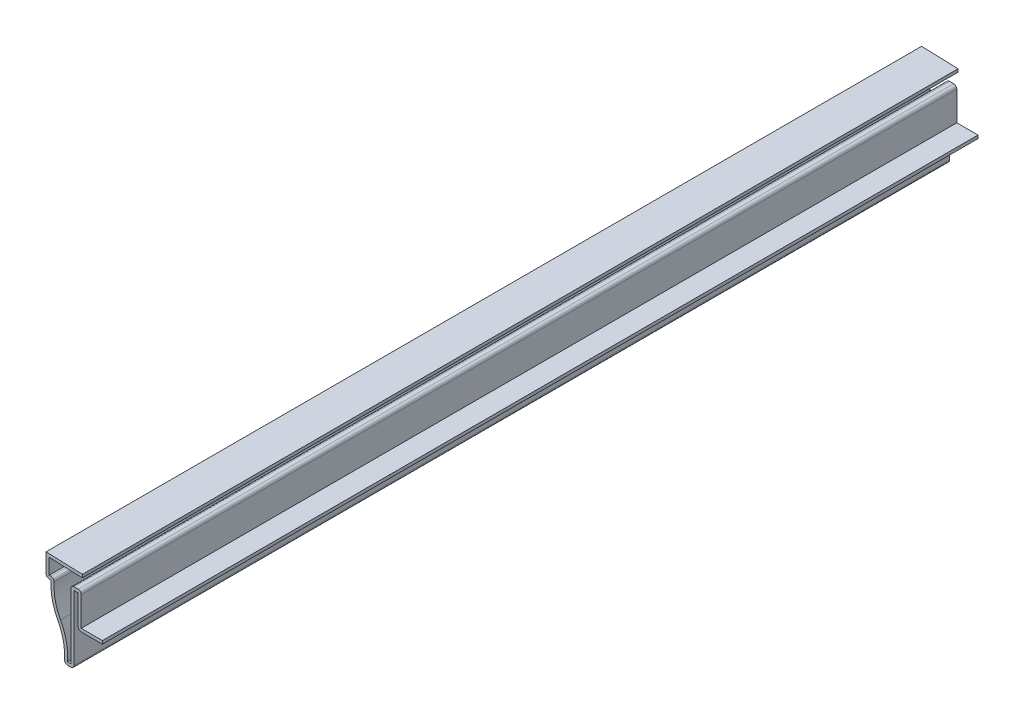
ISO-10303-21;
HEADER;
FILE_DESCRIPTION(('STEP AP214'),'2;1');
FILE_NAME('part.step','',(''),(''),'','','');
FILE_SCHEMA(('AUTOMOTIVE_DESIGN { 1 0 10303 214 1 1 1 1 }'));
ENDSEC;
DATA;
#1=APPLICATION_CONTEXT('core data for automotive mechanical design processes');
#2=APPLICATION_PROTOCOL_DEFINITION('international standard','automotive_design',2000,#1);
#3=PRODUCT_CONTEXT('',#1,'mechanical');
#4=PRODUCT('Part','Part','',(#3));
#5=PRODUCT_RELATED_PRODUCT_CATEGORY('part','',(#4));
#6=PRODUCT_DEFINITION_FORMATION('','',#4);
#7=PRODUCT_DEFINITION_CONTEXT('part definition',#1,'design');
#8=PRODUCT_DEFINITION('design','',#6,#7);
#9=PRODUCT_DEFINITION_SHAPE('','',#8);
#10=(LENGTH_UNIT() NAMED_UNIT(*) SI_UNIT(.MILLI.,.METRE.));
#11=(NAMED_UNIT(*) PLANE_ANGLE_UNIT() SI_UNIT($,.RADIAN.));
#12=(NAMED_UNIT(*) SI_UNIT($,.STERADIAN.) SOLID_ANGLE_UNIT());
#13=UNCERTAINTY_MEASURE_WITH_UNIT(LENGTH_MEASURE(1.E-05),#10,'distance_accuracy_value','');
#14=(GEOMETRIC_REPRESENTATION_CONTEXT(3) GLOBAL_UNCERTAINTY_ASSIGNED_CONTEXT((#13)) GLOBAL_UNIT_ASSIGNED_CONTEXT((#10,
#11,#12)) REPRESENTATION_CONTEXT('',''));
#15=CARTESIAN_POINT('',(0.,0.,0.));
#16=DIRECTION('',(0.,0.,1.));
#17=DIRECTION('',(1.,0.,0.));
#18=AXIS2_PLACEMENT_3D('',#15,#16,#17);
#19=CARTESIAN_POINT('',(0.,0.,-285.75));
#20=DIRECTION('',(0.,-1.,0.));
#21=DIRECTION('',(1.,0.,0.));
#22=AXIS2_PLACEMENT_3D('',#19,#20,#21);
#23=PLANE('',#22);
#24=DIRECTION('',(1.,0.,0.));
#25=VECTOR('',#24,1.);
#26=CARTESIAN_POINT('',(0.,0.,0.));
#27=LINE('',#26,#25);
#28=CARTESIAN_POINT('',(-2.06337759684985,0.,0.));
#29=VERTEX_POINT('',#28);
#30=CARTESIAN_POINT('',(-1.016,0.,0.));
#31=VERTEX_POINT('',#30);
#32=EDGE_CURVE('E300',#29,#31,#27,.T.);
#33=ORIENTED_EDGE('',*,*,#32,.F.);
#34=DIRECTION('',(0.,0.,1.));
#35=VECTOR('',#34,1.);
#36=CARTESIAN_POINT('',(-2.06337759684985,0.,-285.75));
#37=LINE('',#36,#35);
#38=CARTESIAN_POINT('',(-2.06337759684985,0.,-285.75));
#39=VERTEX_POINT('',#38);
#40=EDGE_CURVE('E410',#29,#39,#37,.F.);
#41=ORIENTED_EDGE('',*,*,#40,.T.);
#42=DIRECTION('',(1.,0.,0.));
#43=VECTOR('',#42,1.);
#44=CARTESIAN_POINT('',(0.,0.,-285.75));
#45=LINE('',#44,#43);
#46=CARTESIAN_POINT('',(-1.016,0.,-285.75));
#47=VERTEX_POINT('',#46);
#48=EDGE_CURVE('E234',#39,#47,#45,.T.);
#49=ORIENTED_EDGE('',*,*,#48,.T.);
#50=DIRECTION('',(0.,0.,1.));
#51=VECTOR('',#50,1.);
#52=CARTESIAN_POINT('',(-1.016,0.,-285.75));
#53=LINE('',#52,#51);
#54=EDGE_CURVE('E407',#47,#31,#53,.T.);
#55=ORIENTED_EDGE('',*,*,#54,.T.);
#56=EDGE_LOOP('',(#33,#41,#49,#55));
#57=FACE_BOUND('',#56,.T.);
#58=ADVANCED_FACE('F35',(#57),#23,.T.);
#59=CARTESIAN_POINT('',(-22.0911165975646,2.25455824217122,-285.75));
#60=DIRECTION('',(0.,0.,1.));
#61=DIRECTION('',(1.,0.,0.));
#62=AXIS2_PLACEMENT_3D('',#59,#60,#61);
#63=CYLINDRICAL_SURFACE('',#62,19.05);
#64=CARTESIAN_POINT('',(-22.0911165975646,2.25455824217122,-285.75));
#65=DIRECTION('',(0.,0.,-1.));
#66=DIRECTION('',(1.,0.,0.));
#67=AXIS2_PLACEMENT_3D('',#64,#65,#66);
#68=CIRCLE('',#67,19.05);
#69=CARTESIAN_POINT('',(-5.29087079878227,11.2353288717162,-285.75));
#70=VERTEX_POINT('',#69);
#71=CARTESIAN_POINT('',(-3.07744033106325,1.07871180973019,-285.75));
#72=VERTEX_POINT('',#71);
#73=EDGE_CURVE('E242',#70,#72,#68,.T.);
#74=ORIENTED_EDGE('',*,*,#73,.T.);
#75=DIRECTION('',(0.,0.,1.));
#76=VECTOR('',#75,1.);
#77=CARTESIAN_POINT('',(-3.07744033106325,1.07871180973019,-285.75));
#78=LINE('',#77,#76);
#79=CARTESIAN_POINT('',(-3.07744033106325,1.07871180973019,0.));
#80=VERTEX_POINT('',#79);
#81=EDGE_CURVE('E361',#72,#80,#78,.T.);
#82=ORIENTED_EDGE('',*,*,#81,.T.);
#83=CARTESIAN_POINT('',(-22.0911165975646,2.25455824217122,0.));
#84=DIRECTION('',(0.,0.,-1.));
#85=DIRECTION('',(1.,0.,0.));
#86=AXIS2_PLACEMENT_3D('',#83,#84,#85);
#87=CIRCLE('',#86,19.05);
#88=CARTESIAN_POINT('',(-5.29087079878227,11.2353288717162,0.));
#89=VERTEX_POINT('',#88);
#90=EDGE_CURVE('E356',#89,#80,#87,.T.);
#91=ORIENTED_EDGE('',*,*,#90,.F.);
#92=DIRECTION('',(0.,0.,1.));
#93=VECTOR('',#92,1.);
#94=CARTESIAN_POINT('',(-5.29087079878227,11.2353288717162,-285.75));
#95=LINE('',#94,#93);
#96=EDGE_CURVE('E359',#70,#89,#95,.T.);
#97=ORIENTED_EDGE('',*,*,#96,.F.);
#98=EDGE_LOOP('',(#74,#82,#91,#97));
#99=FACE_BOUND('',#98,.T.);
#100=ADVANCED_FACE('F503',(#99),#63,.F.);
#101=CARTESIAN_POINT('',(11.509375,20.2160995012612,-285.75));
#102=DIRECTION('',(0.,0.,1.));
#103=DIRECTION('',(1.,0.,0.));
#104=AXIS2_PLACEMENT_3D('',#101,#102,#103);
#105=CYLINDRICAL_SURFACE('',#104,19.05);
#106=CARTESIAN_POINT('',(11.509375,20.2160995012612,0.));
#107=DIRECTION('',(0.,0.,1.));
#108=DIRECTION('',(-1.,0.,0.));
#109=AXIS2_PLACEMENT_3D('',#106,#107,#108);
#110=CIRCLE('',#109,19.05);
#111=CARTESIAN_POINT('',(-7.50182983466039,21.43125,0.));
#112=VERTEX_POINT('',#111);
#113=EDGE_CURVE('E353',#112,#89,#110,.T.);
#114=ORIENTED_EDGE('',*,*,#113,.F.);
#115=DIRECTION('',(0.,0.,1.));
#116=VECTOR('',#115,1.);
#117=CARTESIAN_POINT('',(-7.50182983466039,21.43125,-285.75));
#118=LINE('',#117,#116);
#119=CARTESIAN_POINT('',(-7.50182983466039,21.43125,-285.75));
#120=VERTEX_POINT('',#119);
#121=EDGE_CURVE('E362',#120,#112,#118,.T.);
#122=ORIENTED_EDGE('',*,*,#121,.F.);
#123=CARTESIAN_POINT('',(11.509375,20.2160995012612,-285.75));
#124=DIRECTION('',(0.,0.,1.));
#125=DIRECTION('',(-1.,0.,0.));
#126=AXIS2_PLACEMENT_3D('',#123,#124,#125);
#127=CIRCLE('',#126,19.05);
#128=EDGE_CURVE('E295',#120,#70,#127,.T.);
#129=ORIENTED_EDGE('',*,*,#128,.T.);
#130=ORIENTED_EDGE('',*,*,#96,.T.);
#131=EDGE_LOOP('',(#114,#122,#129,#130));
#132=FACE_BOUND('',#131,.T.);
#133=ADVANCED_FACE('F500',(#132),#105,.T.);
#134=CARTESIAN_POINT('',(-7.50182983466039,21.43125,-285.75));
#135=DIRECTION('',(0.,-1.,0.));
#136=DIRECTION('',(1.,0.,0.));
#137=AXIS2_PLACEMENT_3D('',#134,#135,#136);
#138=PLANE('',#137);
#139=DIRECTION('',(1.,0.,0.));
#140=VECTOR('',#139,1.);
#141=CARTESIAN_POINT('',(-7.50182983466039,21.43125,0.));
#142=LINE('',#141,#140);
#143=CARTESIAN_POINT('',(-8.112125,21.43125,0.));
#144=VERTEX_POINT('',#143);
#145=EDGE_CURVE('E351',#144,#112,#142,.T.);
#146=ORIENTED_EDGE('',*,*,#145,.F.);
#147=DIRECTION('',(0.,0.,1.));
#148=VECTOR('',#147,1.);
#149=CARTESIAN_POINT('',(-8.112125,21.43125,-285.75));
#150=LINE('',#149,#148);
#151=CARTESIAN_POINT('',(-8.112125,21.43125,-285.75));
#152=VERTEX_POINT('',#151);
#153=EDGE_CURVE('E444',#144,#152,#150,.F.);
#154=ORIENTED_EDGE('',*,*,#153,.T.);
#155=DIRECTION('',(1.,0.,0.));
#156=VECTOR('',#155,1.);
#157=CARTESIAN_POINT('',(-7.50182983466039,21.43125,-285.75));
#158=LINE('',#157,#156);
#159=EDGE_CURVE('E293',#152,#120,#158,.T.);
#160=ORIENTED_EDGE('',*,*,#159,.T.);
#161=ORIENTED_EDGE('',*,*,#121,.T.);
#162=EDGE_LOOP('',(#146,#154,#160,#161));
#163=FACE_BOUND('',#162,.T.);
#164=ADVANCED_FACE('F494',(#163),#138,.T.);
#165=CARTESIAN_POINT('',(-9.128125,21.43125,-285.75));
#166=DIRECTION('',(-1.,0.,0.));
#167=DIRECTION('',(0.,0.,1.));
#168=AXIS2_PLACEMENT_3D('',#165,#166,#167);
#169=PLANE('',#168);
#170=DIRECTION('',(0.,-1.,0.));
#171=VECTOR('',#170,1.);
#172=CARTESIAN_POINT('',(-9.128125,21.43125,-285.75));
#173=LINE('',#172,#171);
#174=CARTESIAN_POINT('',(-9.128125,28.575,-285.75));
#175=VERTEX_POINT('',#174);
#176=CARTESIAN_POINT('',(-9.128125,22.44725,-285.75));
#177=VERTEX_POINT('',#176);
#178=EDGE_CURVE('E290',#175,#177,#173,.T.);
#179=ORIENTED_EDGE('',*,*,#178,.T.);
#180=DIRECTION('',(0.,0.,1.));
#181=VECTOR('',#180,1.);
#182=CARTESIAN_POINT('',(-9.128125,22.44725,-285.75));
#183=LINE('',#182,#181);
#184=CARTESIAN_POINT('',(-9.128125,22.44725,0.));
#185=VERTEX_POINT('',#184);
#186=EDGE_CURVE('E441',#177,#185,#183,.T.);
#187=ORIENTED_EDGE('',*,*,#186,.T.);
#188=DIRECTION('',(0.,-1.,0.));
#189=VECTOR('',#188,1.);
#190=CARTESIAN_POINT('',(-9.128125,21.43125,0.));
#191=LINE('',#190,#189);
#192=CARTESIAN_POINT('',(-9.128125,28.575,0.));
#193=VERTEX_POINT('',#192);
#194=EDGE_CURVE('E348',#193,#185,#191,.T.);
#195=ORIENTED_EDGE('',*,*,#194,.F.);
#196=DIRECTION('',(0.,0.,1.));
#197=VECTOR('',#196,1.);
#198=CARTESIAN_POINT('',(-9.128125,28.575,-285.75));
#199=LINE('',#198,#197);
#200=EDGE_CURVE('E365',#175,#193,#199,.T.);
#201=ORIENTED_EDGE('',*,*,#200,.F.);
#202=EDGE_LOOP('',(#179,#187,#195,#201));
#203=FACE_BOUND('',#202,.T.);
#204=ADVANCED_FACE('F486',(#203),#169,.T.);
#205=CARTESIAN_POINT('',(-9.128125,28.575,-285.75));
#206=DIRECTION('',(0.0333148302326386,0.999444906979154,0.));
#207=DIRECTION('',(-0.999444906979154,0.0333148302326386,0.));
#208=AXIS2_PLACEMENT_3D('',#205,#206,#207);
#209=PLANE('',#208);
#210=DIRECTION('',(-0.999444906979154,0.0333148302326386,0.));
#211=VECTOR('',#210,1.);
#212=CARTESIAN_POINT('',(-9.128125,28.575,0.));
#213=LINE('',#212,#211);
#214=CARTESIAN_POINT('',(2.778125,28.178125,0.));
#215=VERTEX_POINT('',#214);
#216=EDGE_CURVE('E345',#215,#193,#213,.T.);
#217=ORIENTED_EDGE('',*,*,#216,.F.);
#218=DIRECTION('',(0.,0.,1.));
#219=VECTOR('',#218,1.);
#220=CARTESIAN_POINT('',(2.778125,28.178125,-285.75));
#221=LINE('',#220,#219);
#222=CARTESIAN_POINT('',(2.778125,28.178125,-285.75));
#223=VERTEX_POINT('',#222);
#224=EDGE_CURVE('E367',#223,#215,#221,.T.);
#225=ORIENTED_EDGE('',*,*,#224,.F.);
#226=DIRECTION('',(-0.999444906979154,0.0333148302326386,0.));
#227=VECTOR('',#226,1.);
#228=CARTESIAN_POINT('',(-9.128125,28.575,-285.75));
#229=LINE('',#228,#227);
#230=EDGE_CURVE('E287',#223,#175,#229,.T.);
#231=ORIENTED_EDGE('',*,*,#230,.T.);
#232=ORIENTED_EDGE('',*,*,#200,.T.);
#233=EDGE_LOOP('',(#217,#225,#231,#232));
#234=FACE_BOUND('',#233,.T.);
#235=ADVANCED_FACE('F482',(#234),#209,.T.);
#236=CARTESIAN_POINT('',(2.778125,28.178125,-285.75));
#237=DIRECTION('',(0.999444906979154,-0.0333148302326371,0.));
#238=DIRECTION('',(0.0333148302326371,0.999444906979154,0.));
#239=AXIS2_PLACEMENT_3D('',#236,#237,#238);
#240=PLANE('',#239);
#241=DIRECTION('',(0.0333148302326371,0.999444906979154,0.));
#242=VECTOR('',#241,1.);
#243=CARTESIAN_POINT('',(2.778125,28.178125,0.));
#244=LINE('',#243,#242);
#245=CARTESIAN_POINT('',(2.74427713248364,27.1626889745092,0.));
#246=VERTEX_POINT('',#245);
#247=EDGE_CURVE('E342',#246,#215,#244,.T.);
#248=ORIENTED_EDGE('',*,*,#247,.F.);
#249=DIRECTION('',(0.,0.,1.));
#250=VECTOR('',#249,1.);
#251=CARTESIAN_POINT('',(2.74427713248364,27.1626889745092,-285.75));
#252=LINE('',#251,#250);
#253=CARTESIAN_POINT('',(2.74427713248364,27.1626889745092,-285.75));
#254=VERTEX_POINT('',#253);
#255=EDGE_CURVE('E369',#254,#246,#252,.T.);
#256=ORIENTED_EDGE('',*,*,#255,.F.);
#257=DIRECTION('',(0.0333148302326371,0.999444906979154,0.));
#258=VECTOR('',#257,1.);
#259=CARTESIAN_POINT('',(2.778125,28.178125,-285.75));
#260=LINE('',#259,#258);
#261=EDGE_CURVE('E284',#254,#223,#260,.T.);
#262=ORIENTED_EDGE('',*,*,#261,.T.);
#263=ORIENTED_EDGE('',*,*,#224,.T.);
#264=EDGE_LOOP('',(#248,#256,#262,#263));
#265=FACE_BOUND('',#264,.T.);
#266=ADVANCED_FACE('F478',(#265),#240,.T.);
#267=CARTESIAN_POINT('',(-8.112125,27.524569045592,-285.75));
#268=DIRECTION('',(-0.0333148302326387,-0.999444906979154,0.));
#269=DIRECTION('',(0.999444906979154,-0.0333148302326387,0.));
#270=AXIS2_PLACEMENT_3D('',#267,#268,#269);
#271=PLANE('',#270);
#272=DIRECTION('',(0.999444906979154,-0.0333148302326387,0.));
#273=VECTOR('',#272,1.);
#274=CARTESIAN_POINT('',(-8.112125,27.524569045592,0.));
#275=LINE('',#274,#273);
#276=CARTESIAN_POINT('',(-8.112125,27.524569045592,0.));
#277=VERTEX_POINT('',#276);
#278=EDGE_CURVE('E339',#277,#246,#275,.T.);
#279=ORIENTED_EDGE('',*,*,#278,.F.);
#280=DIRECTION('',(0.,0.,1.));
#281=VECTOR('',#280,1.);
#282=CARTESIAN_POINT('',(-8.112125,27.524569045592,-285.75));
#283=LINE('',#282,#281);
#284=CARTESIAN_POINT('',(-8.112125,27.524569045592,-285.75));
#285=VERTEX_POINT('',#284);
#286=EDGE_CURVE('E371',#285,#277,#283,.T.);
#287=ORIENTED_EDGE('',*,*,#286,.F.);
#288=DIRECTION('',(0.999444906979154,-0.0333148302326387,0.));
#289=VECTOR('',#288,1.);
#290=CARTESIAN_POINT('',(-8.112125,27.524569045592,-285.75));
#291=LINE('',#290,#289);
#292=EDGE_CURVE('E281',#285,#254,#291,.T.);
#293=ORIENTED_EDGE('',*,*,#292,.T.);
#294=ORIENTED_EDGE('',*,*,#255,.T.);
#295=EDGE_LOOP('',(#279,#287,#293,#294));
#296=FACE_BOUND('',#295,.T.);
#297=ADVANCED_FACE('F474',(#296),#271,.T.);
#298=CARTESIAN_POINT('',(-8.112125,22.44725,-285.75));
#299=DIRECTION('',(1.,0.,0.));
#300=DIRECTION('',(0.,0.,-1.));
#301=AXIS2_PLACEMENT_3D('',#298,#299,#300);
#302=PLANE('',#301);
#303=DIRECTION('',(0.,1.,0.));
#304=VECTOR('',#303,1.);
#305=CARTESIAN_POINT('',(-8.112125,22.44725,0.));
#306=LINE('',#305,#304);
#307=CARTESIAN_POINT('',(-8.112125,22.44725,0.));
#308=VERTEX_POINT('',#307);
#309=EDGE_CURVE('E336',#308,#277,#306,.T.);
#310=ORIENTED_EDGE('',*,*,#309,.F.);
#311=DIRECTION('',(0.,0.,1.));
#312=VECTOR('',#311,1.);
#313=CARTESIAN_POINT('',(-8.112125,22.44725,-285.75));
#314=LINE('',#313,#312);
#315=CARTESIAN_POINT('',(-8.112125,22.44725,-285.75));
#316=VERTEX_POINT('',#315);
#317=EDGE_CURVE('E373',#316,#308,#314,.T.);
#318=ORIENTED_EDGE('',*,*,#317,.F.);
#319=DIRECTION('',(0.,1.,0.));
#320=VECTOR('',#319,1.);
#321=CARTESIAN_POINT('',(-8.112125,22.44725,-285.75));
#322=LINE('',#321,#320);
#323=EDGE_CURVE('E278',#316,#285,#322,.T.);
#324=ORIENTED_EDGE('',*,*,#323,.T.);
#325=ORIENTED_EDGE('',*,*,#286,.T.);
#326=EDGE_LOOP('',(#310,#318,#324,#325));
#327=FACE_BOUND('',#326,.T.);
#328=ADVANCED_FACE('F471',(#327),#302,.T.);
#329=CARTESIAN_POINT('',(-6.38607479741994,22.44725,-285.75));
#330=DIRECTION('',(0.,1.,0.));
#331=DIRECTION('',(0.,0.,1.));
#332=AXIS2_PLACEMENT_3D('',#329,#330,#331);
#333=PLANE('',#332);
#334=DIRECTION('',(-1.,0.,0.));
#335=VECTOR('',#334,1.);
#336=CARTESIAN_POINT('',(-6.38607479741994,22.44725,0.));
#337=LINE('',#336,#335);
#338=CARTESIAN_POINT('',(-7.50182983466039,22.44725,0.));
#339=VERTEX_POINT('',#338);
#340=EDGE_CURVE('E334',#339,#308,#337,.T.);
#341=ORIENTED_EDGE('',*,*,#340,.F.);
#342=DIRECTION('',(0.,0.,1.));
#343=VECTOR('',#342,1.);
#344=CARTESIAN_POINT('',(-7.50182983466039,22.44725,-285.75));
#345=LINE('',#344,#343);
#346=CARTESIAN_POINT('',(-7.50182983466039,22.44725,-285.75));
#347=VERTEX_POINT('',#346);
#348=EDGE_CURVE('E11',#339,#347,#345,.F.);
#349=ORIENTED_EDGE('',*,*,#348,.T.);
#350=DIRECTION('',(-1.,0.,0.));
#351=VECTOR('',#350,1.);
#352=CARTESIAN_POINT('',(-6.38607479741994,22.44725,-285.75));
#353=LINE('',#352,#351);
#354=EDGE_CURVE('E276',#347,#316,#353,.T.);
#355=ORIENTED_EDGE('',*,*,#354,.T.);
#356=ORIENTED_EDGE('',*,*,#317,.T.);
#357=EDGE_LOOP('',(#341,#349,#355,#356));
#358=FACE_BOUND('',#357,.T.);
#359=ADVANCED_FACE('F466',(#358),#333,.T.);
#360=CARTESIAN_POINT('',(11.509375,20.2160995012612,-285.75));
#361=DIRECTION('',(0.,0.,1.));
#362=DIRECTION('',(1.,0.,0.));
#363=AXIS2_PLACEMENT_3D('',#360,#361,#362);
#364=CYLINDRICAL_SURFACE('',#363,18.034);
#365=CARTESIAN_POINT('',(11.509375,20.2160995012612,-285.75));
#366=DIRECTION('',(0.,0.,-1.));
#367=DIRECTION('',(-1.,0.,0.));
#368=AXIS2_PLACEMENT_3D('',#365,#366,#367);
#369=CIRCLE('',#368,18.034);
#370=CARTESIAN_POINT('',(-4.3948576895139,11.714303305292,-285.75));
#371=VERTEX_POINT('',#370);
#372=CARTESIAN_POINT('',(-6.48789891014517,21.3664419734006,-285.75));
#373=VERTEX_POINT('',#372);
#374=EDGE_CURVE('E273',#371,#373,#369,.T.);
#375=ORIENTED_EDGE('',*,*,#374,.T.);
#376=DIRECTION('',(0.,0.,1.));
#377=VECTOR('',#376,1.);
#378=CARTESIAN_POINT('',(-6.48789891014517,21.3664419734006,-285.75));
#379=LINE('',#378,#377);
#380=CARTESIAN_POINT('',(-6.48789891014517,21.3664419734006,0.));
#381=VERTEX_POINT('',#380);
#382=EDGE_CURVE('E43',#373,#381,#379,.T.);
#383=ORIENTED_EDGE('',*,*,#382,.T.);
#384=CARTESIAN_POINT('',(11.509375,20.2160995012612,0.));
#385=DIRECTION('',(0.,0.,-1.));
#386=DIRECTION('',(-1.,0.,0.));
#387=AXIS2_PLACEMENT_3D('',#384,#385,#386);
#388=CIRCLE('',#387,18.034);
#389=CARTESIAN_POINT('',(-4.3948576895139,11.714303305292,0.));
#390=VERTEX_POINT('',#389);
#391=EDGE_CURVE('E331',#390,#381,#388,.T.);
#392=ORIENTED_EDGE('',*,*,#391,.F.);
#393=DIRECTION('',(0.,0.,1.));
#394=VECTOR('',#393,1.);
#395=CARTESIAN_POINT('',(-4.3948576895139,11.714303305292,-285.75));
#396=LINE('',#395,#394);
#397=EDGE_CURVE('E376',#371,#390,#396,.T.);
#398=ORIENTED_EDGE('',*,*,#397,.F.);
#399=EDGE_LOOP('',(#375,#383,#392,#398));
#400=FACE_BOUND('',#399,.T.);
#401=ADVANCED_FACE('F449',(#400),#364,.F.);
#402=CARTESIAN_POINT('',(-22.0911165975646,2.25455824217122,-285.75));
#403=DIRECTION('',(0.,0.,1.));
#404=DIRECTION('',(1.,0.,0.));
#405=AXIS2_PLACEMENT_3D('',#402,#403,#404);
#406=CYLINDRICAL_SURFACE('',#405,20.066);
#407=CARTESIAN_POINT('',(-22.0911165975646,2.25455824217122,0.));
#408=DIRECTION('',(0.,0.,1.));
#409=DIRECTION('',(1.,0.,0.));
#410=AXIS2_PLACEMENT_3D('',#407,#408,#409);
#411=CIRCLE('',#410,20.066);
#412=CARTESIAN_POINT('',(-2.06337759684985,1.016,0.));
#413=VERTEX_POINT('',#412);
#414=EDGE_CURVE('E328',#413,#390,#411,.T.);
#415=ORIENTED_EDGE('',*,*,#414,.F.);
#416=DIRECTION('',(0.,0.,1.));
#417=VECTOR('',#416,1.);
#418=CARTESIAN_POINT('',(-2.06337759684985,1.016,-285.75));
#419=LINE('',#418,#417);
#420=CARTESIAN_POINT('',(-2.06337759684985,1.016,-285.75));
#421=VERTEX_POINT('',#420);
#422=EDGE_CURVE('E378',#421,#413,#419,.T.);
#423=ORIENTED_EDGE('',*,*,#422,.F.);
#424=CARTESIAN_POINT('',(-22.0911165975646,2.25455824217122,-285.75));
#425=DIRECTION('',(0.,0.,1.));
#426=DIRECTION('',(1.,0.,0.));
#427=AXIS2_PLACEMENT_3D('',#424,#425,#426);
#428=CIRCLE('',#427,20.066);
#429=EDGE_CURVE('E270',#421,#371,#428,.T.);
#430=ORIENTED_EDGE('',*,*,#429,.T.);
#431=ORIENTED_EDGE('',*,*,#397,.T.);
#432=EDGE_LOOP('',(#415,#423,#430,#431));
#433=FACE_BOUND('',#432,.T.);
#434=ADVANCED_FACE('F459',(#433),#406,.T.);
#435=CARTESIAN_POINT('',(-1.016,1.016,-285.75));
#436=DIRECTION('',(0.,1.,0.));
#437=DIRECTION('',(0.,0.,1.));
#438=AXIS2_PLACEMENT_3D('',#435,#436,#437);
#439=PLANE('',#438);
#440=DIRECTION('',(-1.,0.,0.));
#441=VECTOR('',#440,1.);
#442=CARTESIAN_POINT('',(-1.016,1.016,0.));
#443=LINE('',#442,#441);
#444=CARTESIAN_POINT('',(-1.016,1.016,0.));
#445=VERTEX_POINT('',#444);
#446=EDGE_CURVE('E325',#445,#413,#443,.T.);
#447=ORIENTED_EDGE('',*,*,#446,.F.);
#448=DIRECTION('',(0.,0.,1.));
#449=VECTOR('',#448,1.);
#450=CARTESIAN_POINT('',(-1.016,1.016,-285.75));
#451=LINE('',#450,#449);
#452=CARTESIAN_POINT('',(-1.016,1.016,-285.75));
#453=VERTEX_POINT('',#452);
#454=EDGE_CURVE('E380',#453,#445,#451,.T.);
#455=ORIENTED_EDGE('',*,*,#454,.F.);
#456=DIRECTION('',(-1.,0.,0.));
#457=VECTOR('',#456,1.);
#458=CARTESIAN_POINT('',(-1.016,1.016,-285.75));
#459=LINE('',#458,#457);
#460=EDGE_CURVE('E267',#453,#421,#459,.T.);
#461=ORIENTED_EDGE('',*,*,#460,.T.);
#462=ORIENTED_EDGE('',*,*,#422,.T.);
#463=EDGE_LOOP('',(#447,#455,#461,#462));
#464=FACE_BOUND('',#463,.T.);
#465=ADVANCED_FACE('F559',(#464),#439,.T.);
#466=CARTESIAN_POINT('',(-1.016,1.016,-285.75));
#467=DIRECTION('',(-1.,0.,0.));
#468=DIRECTION('',(0.,0.,1.));
#469=AXIS2_PLACEMENT_3D('',#466,#467,#468);
#470=PLANE('',#469);
#471=DIRECTION('',(0.,-1.,0.));
#472=VECTOR('',#471,1.);
#473=CARTESIAN_POINT('',(-1.016,1.016,0.));
#474=LINE('',#473,#472);
#475=CARTESIAN_POINT('',(-1.016,22.225,0.));
#476=VERTEX_POINT('',#475);
#477=EDGE_CURVE('E323',#476,#445,#474,.T.);
#478=ORIENTED_EDGE('',*,*,#477,.F.);
#479=DIRECTION('',(0.,0.,1.));
#480=VECTOR('',#479,1.);
#481=CARTESIAN_POINT('',(-1.016,22.225,-285.75));
#482=LINE('',#481,#480);
#483=CARTESIAN_POINT('',(-1.016,22.225,-285.75));
#484=VERTEX_POINT('',#483);
#485=EDGE_CURVE('E439',#476,#484,#482,.F.);
#486=ORIENTED_EDGE('',*,*,#485,.T.);
#487=DIRECTION('',(0.,-1.,0.));
#488=VECTOR('',#487,1.);
#489=CARTESIAN_POINT('',(-1.016,1.016,-285.75));
#490=LINE('',#489,#488);
#491=EDGE_CURVE('E265',#484,#453,#490,.T.);
#492=ORIENTED_EDGE('',*,*,#491,.T.);
#493=ORIENTED_EDGE('',*,*,#454,.T.);
#494=EDGE_LOOP('',(#478,#486,#492,#493));
#495=FACE_BOUND('',#494,.T.);
#496=ADVANCED_FACE('F555',(#495),#470,.T.);
#497=CARTESIAN_POINT('',(-1.016,23.241,-285.75));
#498=DIRECTION('',(0.,1.,0.));
#499=DIRECTION('',(0.,0.,1.));
#500=AXIS2_PLACEMENT_3D('',#497,#498,#499);
#501=PLANE('',#500);
#502=DIRECTION('',(-1.,0.,0.));
#503=VECTOR('',#502,1.);
#504=CARTESIAN_POINT('',(-1.016,23.241,0.));
#505=LINE('',#504,#503);
#506=CARTESIAN_POINT('',(1.3462,23.241,0.));
#507=VERTEX_POINT('',#506);
#508=CARTESIAN_POINT('',(0.,23.241,0.));
#509=VERTEX_POINT('',#508);
#510=EDGE_CURVE('E320',#507,#509,#505,.T.);
#511=ORIENTED_EDGE('',*,*,#510,.F.);
#512=DIRECTION('',(0.,0.,1.));
#513=VECTOR('',#512,1.);
#514=CARTESIAN_POINT('',(1.3462,23.241,-285.75));
#515=LINE('',#514,#513);
#516=CARTESIAN_POINT('',(1.3462,23.241,-285.75));
#517=VERTEX_POINT('',#516);
#518=EDGE_CURVE('E437',#507,#517,#515,.F.);
#519=ORIENTED_EDGE('',*,*,#518,.T.);
#520=DIRECTION('',(-1.,0.,0.));
#521=VECTOR('',#520,1.);
#522=CARTESIAN_POINT('',(-1.016,23.241,-285.75));
#523=LINE('',#522,#521);
#524=CARTESIAN_POINT('',(0.,23.241,-285.75));
#525=VERTEX_POINT('',#524);
#526=EDGE_CURVE('E262',#517,#525,#523,.T.);
#527=ORIENTED_EDGE('',*,*,#526,.T.);
#528=DIRECTION('',(0.,0.,1.));
#529=VECTOR('',#528,1.);
#530=CARTESIAN_POINT('',(0.,23.241,-285.75));
#531=LINE('',#530,#529);
#532=EDGE_CURVE('E434',#525,#509,#531,.T.);
#533=ORIENTED_EDGE('',*,*,#532,.T.);
#534=EDGE_LOOP('',(#511,#519,#527,#533));
#535=FACE_BOUND('',#534,.T.);
#536=ADVANCED_FACE('F546',(#535),#501,.T.);
#537=CARTESIAN_POINT('',(2.3622,23.241,-285.75));
#538=DIRECTION('',(1.,0.,0.));
#539=DIRECTION('',(0.,1.,0.));
#540=AXIS2_PLACEMENT_3D('',#537,#538,#539);
#541=PLANE('',#540);
#542=DIRECTION('',(0.,1.,0.));
#543=VECTOR('',#542,1.);
#544=CARTESIAN_POINT('',(2.3622,23.241,-285.75));
#545=LINE('',#544,#543);
#546=CARTESIAN_POINT('',(2.3622,12.7,-285.75));
#547=VERTEX_POINT('',#546);
#548=CARTESIAN_POINT('',(2.3622,22.225,-285.75));
#549=VERTEX_POINT('',#548);
#550=EDGE_CURVE('E259',#547,#549,#545,.T.);
#551=ORIENTED_EDGE('',*,*,#550,.T.);
#552=DIRECTION('',(0.,0.,1.));
#553=VECTOR('',#552,1.);
#554=CARTESIAN_POINT('',(2.3622,22.225,-285.75));
#555=LINE('',#554,#553);
#556=CARTESIAN_POINT('',(2.3622,22.225,0.));
#557=VERTEX_POINT('',#556);
#558=EDGE_CURVE('E431',#549,#557,#555,.T.);
#559=ORIENTED_EDGE('',*,*,#558,.T.);
#560=DIRECTION('',(0.,1.,0.));
#561=VECTOR('',#560,1.);
#562=CARTESIAN_POINT('',(2.3622,23.241,0.));
#563=LINE('',#562,#561);
#564=CARTESIAN_POINT('',(2.3622,12.7,0.));
#565=VERTEX_POINT('',#564);
#566=EDGE_CURVE('E317',#565,#557,#563,.T.);
#567=ORIENTED_EDGE('',*,*,#566,.F.);
#568=DIRECTION('',(0.,0.,1.));
#569=VECTOR('',#568,1.);
#570=CARTESIAN_POINT('',(2.3622,12.7,-285.75));
#571=LINE('',#570,#569);
#572=EDGE_CURVE('E383',#547,#565,#571,.T.);
#573=ORIENTED_EDGE('',*,*,#572,.F.);
#574=EDGE_LOOP('',(#551,#559,#567,#573));
#575=FACE_BOUND('',#574,.T.);
#576=ADVANCED_FACE('F538',(#575),#541,.T.);
#577=CARTESIAN_POINT('',(2.3622,12.7,-285.75));
#578=DIRECTION('',(0.,1.,0.));
#579=DIRECTION('',(0.,0.,1.));
#580=AXIS2_PLACEMENT_3D('',#577,#578,#579);
#581=PLANE('',#580);
#582=DIRECTION('',(-1.,0.,0.));
#583=VECTOR('',#582,1.);
#584=CARTESIAN_POINT('',(2.3622,12.7,0.));
#585=LINE('',#584,#583);
#586=CARTESIAN_POINT('',(9.2837,12.7,0.));
#587=VERTEX_POINT('',#586);
#588=EDGE_CURVE('E314',#587,#565,#585,.T.);
#589=ORIENTED_EDGE('',*,*,#588,.F.);
#590=DIRECTION('',(0.,0.,1.));
#591=VECTOR('',#590,1.);
#592=CARTESIAN_POINT('',(9.2837,12.7,-285.75));
#593=LINE('',#592,#591);
#594=CARTESIAN_POINT('',(9.2837,12.7,-285.75));
#595=VERTEX_POINT('',#594);
#596=EDGE_CURVE('E385',#595,#587,#593,.T.);
#597=ORIENTED_EDGE('',*,*,#596,.F.);
#598=DIRECTION('',(-1.,0.,0.));
#599=VECTOR('',#598,1.);
#600=CARTESIAN_POINT('',(2.3622,12.7,-285.75));
#601=LINE('',#600,#599);
#602=EDGE_CURVE('E256',#595,#547,#601,.T.);
#603=ORIENTED_EDGE('',*,*,#602,.T.);
#604=ORIENTED_EDGE('',*,*,#572,.T.);
#605=EDGE_LOOP('',(#589,#597,#603,#604));
#606=FACE_BOUND('',#605,.T.);
#607=ADVANCED_FACE('F536',(#606),#581,.T.);
#608=CARTESIAN_POINT('',(9.2837,11.684,-285.75));
#609=DIRECTION('',(1.,0.,0.));
#610=DIRECTION('',(0.,0.,-1.));
#611=AXIS2_PLACEMENT_3D('',#608,#609,#610);
#612=PLANE('',#611);
#613=DIRECTION('',(0.,1.,0.));
#614=VECTOR('',#613,1.);
#615=CARTESIAN_POINT('',(9.2837,11.684,0.));
#616=LINE('',#615,#614);
#617=CARTESIAN_POINT('',(9.2837,11.684,0.));
#618=VERTEX_POINT('',#617);
#619=EDGE_CURVE('E311',#618,#587,#616,.T.);
#620=ORIENTED_EDGE('',*,*,#619,.F.);
#621=DIRECTION('',(0.,0.,1.));
#622=VECTOR('',#621,1.);
#623=CARTESIAN_POINT('',(9.2837,11.684,-285.75));
#624=LINE('',#623,#622);
#625=CARTESIAN_POINT('',(9.2837,11.684,-285.75));
#626=VERTEX_POINT('',#625);
#627=EDGE_CURVE('E387',#626,#618,#624,.T.);
#628=ORIENTED_EDGE('',*,*,#627,.F.);
#629=DIRECTION('',(0.,1.,0.));
#630=VECTOR('',#629,1.);
#631=CARTESIAN_POINT('',(9.2837,11.684,-285.75));
#632=LINE('',#631,#630);
#633=EDGE_CURVE('E253',#626,#595,#632,.T.);
#634=ORIENTED_EDGE('',*,*,#633,.T.);
#635=ORIENTED_EDGE('',*,*,#596,.T.);
#636=EDGE_LOOP('',(#620,#628,#634,#635));
#637=FACE_BOUND('',#636,.T.);
#638=ADVANCED_FACE('F532',(#637),#612,.T.);
#639=CARTESIAN_POINT('',(1.3462,11.684,-285.75));
#640=DIRECTION('',(0.,-1.,0.));
#641=DIRECTION('',(0.,0.,-1.));
#642=AXIS2_PLACEMENT_3D('',#639,#640,#641);
#643=PLANE('',#642);
#644=DIRECTION('',(1.,0.,0.));
#645=VECTOR('',#644,1.);
#646=CARTESIAN_POINT('',(1.3462,11.684,0.));
#647=LINE('',#646,#645);
#648=CARTESIAN_POINT('',(2.3622,11.684,0.));
#649=VERTEX_POINT('',#648);
#650=EDGE_CURVE('E309',#649,#618,#647,.T.);
#651=ORIENTED_EDGE('',*,*,#650,.F.);
#652=DIRECTION('',(0.,0.,1.));
#653=VECTOR('',#652,1.);
#654=CARTESIAN_POINT('',(2.3622,11.684,-285.75));
#655=LINE('',#654,#653);
#656=CARTESIAN_POINT('',(2.3622,11.684,-285.75));
#657=VERTEX_POINT('',#656);
#658=EDGE_CURVE('E429',#649,#657,#655,.F.);
#659=ORIENTED_EDGE('',*,*,#658,.T.);
#660=DIRECTION('',(1.,0.,0.));
#661=VECTOR('',#660,1.);
#662=CARTESIAN_POINT('',(1.3462,11.684,-285.75));
#663=LINE('',#662,#661);
#664=EDGE_CURVE('E248',#657,#626,#663,.T.);
#665=ORIENTED_EDGE('',*,*,#664,.T.);
#666=ORIENTED_EDGE('',*,*,#627,.T.);
#667=EDGE_LOOP('',(#651,#659,#665,#666));
#668=FACE_BOUND('',#667,.T.);
#669=ADVANCED_FACE('F525',(#668),#643,.T.);
#670=CARTESIAN_POINT('',(1.3462,22.225,-285.75));
#671=DIRECTION('',(-1.,0.,0.));
#672=DIRECTION('',(0.,-1.,0.));
#673=AXIS2_PLACEMENT_3D('',#670,#671,#672);
#674=PLANE('',#673);
#675=DIRECTION('',(0.,-1.,0.));
#676=VECTOR('',#675,1.);
#677=CARTESIAN_POINT('',(1.3462,22.225,-285.75));
#678=LINE('',#677,#676);
#679=CARTESIAN_POINT('',(1.3462,22.225,-285.75));
#680=VERTEX_POINT('',#679);
#681=CARTESIAN_POINT('',(1.3462,12.7,-285.75));
#682=VERTEX_POINT('',#681);
#683=EDGE_CURVE('E246',#680,#682,#678,.T.);
#684=ORIENTED_EDGE('',*,*,#683,.T.);
#685=DIRECTION('',(0.,0.,1.));
#686=VECTOR('',#685,1.);
#687=CARTESIAN_POINT('',(1.3462,12.7,-285.75));
#688=LINE('',#687,#686);
#689=CARTESIAN_POINT('',(1.3462,12.7,0.));
#690=VERTEX_POINT('',#689);
#691=EDGE_CURVE('E426',#682,#690,#688,.T.);
#692=ORIENTED_EDGE('',*,*,#691,.T.);
#693=DIRECTION('',(0.,-1.,0.));
#694=VECTOR('',#693,1.);
#695=CARTESIAN_POINT('',(1.3462,22.225,0.));
#696=LINE('',#695,#694);
#697=CARTESIAN_POINT('',(1.3462,22.225,0.));
#698=VERTEX_POINT('',#697);
#699=EDGE_CURVE('E306',#698,#690,#696,.T.);
#700=ORIENTED_EDGE('',*,*,#699,.F.);
#701=DIRECTION('',(0.,0.,1.));
#702=VECTOR('',#701,1.);
#703=CARTESIAN_POINT('',(1.3462,22.225,-285.75));
#704=LINE('',#703,#702);
#705=EDGE_CURVE('E241',#680,#698,#704,.T.);
#706=ORIENTED_EDGE('',*,*,#705,.F.);
#707=EDGE_LOOP('',(#684,#692,#700,#706));
#708=FACE_BOUND('',#707,.T.);
#709=ADVANCED_FACE('F519',(#708),#674,.T.);
#710=CARTESIAN_POINT('',(0.,22.225,-285.75));
#711=DIRECTION('',(0.,-1.,0.));
#712=DIRECTION('',(0.,0.,-1.));
#713=AXIS2_PLACEMENT_3D('',#710,#711,#712);
#714=PLANE('',#713);
#715=DIRECTION('',(1.,0.,0.));
#716=VECTOR('',#715,1.);
#717=CARTESIAN_POINT('',(0.,22.225,0.));
#718=LINE('',#717,#716);
#719=CARTESIAN_POINT('',(0.,22.225,0.));
#720=VERTEX_POINT('',#719);
#721=EDGE_CURVE('E240',#720,#698,#718,.T.);
#722=ORIENTED_EDGE('',*,*,#721,.F.);
#723=DIRECTION('',(0.,0.,1.));
#724=VECTOR('',#723,1.);
#725=CARTESIAN_POINT('',(0.,22.225,-285.75));
#726=LINE('',#725,#724);
#727=CARTESIAN_POINT('',(0.,22.225,-285.75));
#728=VERTEX_POINT('',#727);
#729=EDGE_CURVE('E229',#728,#720,#726,.T.);
#730=ORIENTED_EDGE('',*,*,#729,.F.);
#731=DIRECTION('',(1.,0.,0.));
#732=VECTOR('',#731,1.);
#733=CARTESIAN_POINT('',(0.,22.225,-285.75));
#734=LINE('',#733,#732);
#735=EDGE_CURVE('E233',#728,#680,#734,.T.);
#736=ORIENTED_EDGE('',*,*,#735,.T.);
#737=ORIENTED_EDGE('',*,*,#705,.T.);
#738=EDGE_LOOP('',(#722,#730,#736,#737));
#739=FACE_BOUND('',#738,.T.);
#740=ADVANCED_FACE('F238',(#739),#714,.T.);
#741=CARTESIAN_POINT('',(0.,0.,-285.75));
#742=DIRECTION('',(1.,0.,0.));
#743=DIRECTION('',(0.,0.,-1.));
#744=AXIS2_PLACEMENT_3D('',#741,#742,#743);
#745=PLANE('',#744);
#746=DIRECTION('',(0.,1.,0.));
#747=VECTOR('',#746,1.);
#748=CARTESIAN_POINT('',(0.,0.,0.));
#749=LINE('',#748,#747);
#750=CARTESIAN_POINT('',(0.,1.016,0.));
#751=VERTEX_POINT('',#750);
#752=EDGE_CURVE('E303',#751,#720,#749,.T.);
#753=ORIENTED_EDGE('',*,*,#752,.F.);
#754=DIRECTION('',(0.,0.,1.));
#755=VECTOR('',#754,1.);
#756=CARTESIAN_POINT('',(0.,1.016,-285.75));
#757=LINE('',#756,#755);
#758=CARTESIAN_POINT('',(0.,1.016,-285.75));
#759=VERTEX_POINT('',#758);
#760=EDGE_CURVE('E50',#751,#759,#757,.F.);
#761=ORIENTED_EDGE('',*,*,#760,.T.);
#762=DIRECTION('',(0.,1.,0.));
#763=VECTOR('',#762,1.);
#764=CARTESIAN_POINT('',(0.,0.,-285.75));
#765=LINE('',#764,#763);
#766=EDGE_CURVE('E226',#759,#728,#765,.T.);
#767=ORIENTED_EDGE('',*,*,#766,.T.);
#768=ORIENTED_EDGE('',*,*,#729,.T.);
#769=EDGE_LOOP('',(#753,#761,#767,#768));
#770=FACE_BOUND('',#769,.T.);
#771=ADVANCED_FACE('F228',(#770),#745,.T.);
#772=CARTESIAN_POINT('',(-22.0911165975646,2.25455824217122,-285.75));
#773=DIRECTION('',(0.,0.,1.));
#774=DIRECTION('',(1.,0.,0.));
#775=AXIS2_PLACEMENT_3D('',#772,#773,#774);
#776=PLANE('',#775);
#777=ORIENTED_EDGE('',*,*,#48,.F.);
#778=CARTESIAN_POINT('',(-2.06337759684985,1.016,-285.75));
#779=DIRECTION('',(0.,0.,1.));
#780=DIRECTION('',(1.,0.,0.));
#781=AXIS2_PLACEMENT_3D('',#778,#779,#780);
#782=CIRCLE('',#781,1.016);
#783=EDGE_CURVE('E423',#39,#72,#782,.F.);
#784=ORIENTED_EDGE('',*,*,#783,.T.);
#785=ORIENTED_EDGE('',*,*,#73,.F.);
#786=ORIENTED_EDGE('',*,*,#128,.F.);
#787=ORIENTED_EDGE('',*,*,#159,.F.);
#788=CARTESIAN_POINT('',(-8.112125,22.44725,-285.75));
#789=DIRECTION('',(0.,0.,1.));
#790=DIRECTION('',(1.,0.,0.));
#791=AXIS2_PLACEMENT_3D('',#788,#789,#790);
#792=CIRCLE('',#791,1.016);
#793=EDGE_CURVE('E414',#152,#177,#792,.F.);
#794=ORIENTED_EDGE('',*,*,#793,.T.);
#795=ORIENTED_EDGE('',*,*,#178,.F.);
#796=ORIENTED_EDGE('',*,*,#230,.F.);
#797=ORIENTED_EDGE('',*,*,#261,.F.);
#798=ORIENTED_EDGE('',*,*,#292,.F.);
#799=ORIENTED_EDGE('',*,*,#323,.F.);
#800=ORIENTED_EDGE('',*,*,#354,.F.);
#801=CARTESIAN_POINT('',(-7.50182983466039,21.43125,-285.75));
#802=DIRECTION('',(0.,0.,1.));
#803=DIRECTION('',(1.,0.,0.));
#804=AXIS2_PLACEMENT_3D('',#801,#802,#803);
#805=CIRCLE('',#804,1.016);
#806=EDGE_CURVE('E412',#347,#373,#805,.F.);
#807=ORIENTED_EDGE('',*,*,#806,.T.);
#808=ORIENTED_EDGE('',*,*,#374,.F.);
#809=ORIENTED_EDGE('',*,*,#429,.F.);
#810=ORIENTED_EDGE('',*,*,#460,.F.);
#811=ORIENTED_EDGE('',*,*,#491,.F.);
#812=CARTESIAN_POINT('',(0.,22.225,-285.75));
#813=DIRECTION('',(0.,0.,1.));
#814=DIRECTION('',(1.,0.,0.));
#815=AXIS2_PLACEMENT_3D('',#812,#813,#814);
#816=CIRCLE('',#815,1.016);
#817=EDGE_CURVE('E416',#484,#525,#816,.F.);
#818=ORIENTED_EDGE('',*,*,#817,.T.);
#819=ORIENTED_EDGE('',*,*,#526,.F.);
#820=CARTESIAN_POINT('',(1.3462,22.225,-285.75));
#821=DIRECTION('',(0.,0.,1.));
#822=DIRECTION('',(1.,0.,0.));
#823=AXIS2_PLACEMENT_3D('',#820,#821,#822);
#824=CIRCLE('',#823,1.016);
#825=EDGE_CURVE('E418',#517,#549,#824,.F.);
#826=ORIENTED_EDGE('',*,*,#825,.T.);
#827=ORIENTED_EDGE('',*,*,#550,.F.);
#828=ORIENTED_EDGE('',*,*,#602,.F.);
#829=ORIENTED_EDGE('',*,*,#633,.F.);
#830=ORIENTED_EDGE('',*,*,#664,.F.);
#831=CARTESIAN_POINT('',(2.3622,12.7,-285.75));
#832=DIRECTION('',(0.,0.,1.));
#833=DIRECTION('',(1.,0.,0.));
#834=AXIS2_PLACEMENT_3D('',#831,#832,#833);
#835=CIRCLE('',#834,1.016);
#836=EDGE_CURVE('E58',#657,#682,#835,.F.);
#837=ORIENTED_EDGE('',*,*,#836,.T.);
#838=ORIENTED_EDGE('',*,*,#683,.F.);
#839=ORIENTED_EDGE('',*,*,#735,.F.);
#840=ORIENTED_EDGE('',*,*,#766,.F.);
#841=CARTESIAN_POINT('',(-1.016,1.016,-285.75));
#842=DIRECTION('',(0.,0.,1.));
#843=DIRECTION('',(1.,0.,0.));
#844=AXIS2_PLACEMENT_3D('',#841,#842,#843);
#845=CIRCLE('',#844,1.016);
#846=EDGE_CURVE('E421',#759,#47,#845,.F.);
#847=ORIENTED_EDGE('',*,*,#846,.T.);
#848=EDGE_LOOP('',(#777,#784,#785,#786,#787,#794,#795,#796,#797,#798,#799,#800,#807,#808,#809,
#810,#811,#818,#819,#826,#827,#828,#829,#830,#837,#838,#839,#840,#847));
#849=FACE_BOUND('',#848,.T.);
#850=ADVANCED_FACE('F245',(#849),#776,.F.);
#851=CARTESIAN_POINT('',(-22.0911165975646,2.25455824217122,0.));
#852=DIRECTION('',(0.,0.,1.));
#853=DIRECTION('',(1.,0.,0.));
#854=AXIS2_PLACEMENT_3D('',#851,#852,#853);
#855=PLANE('',#854);
#856=ORIENTED_EDGE('',*,*,#90,.T.);
#857=CARTESIAN_POINT('',(-2.06337759684985,1.016,0.));
#858=DIRECTION('',(0.,0.,1.));
#859=DIRECTION('',(1.,0.,0.));
#860=AXIS2_PLACEMENT_3D('',#857,#858,#859);
#861=CIRCLE('',#860,1.016);
#862=EDGE_CURVE('E405',#80,#29,#861,.T.);
#863=ORIENTED_EDGE('',*,*,#862,.T.);
#864=ORIENTED_EDGE('',*,*,#32,.T.);
#865=CARTESIAN_POINT('',(-1.016,1.016,0.));
#866=DIRECTION('',(0.,0.,1.));
#867=DIRECTION('',(1.,0.,0.));
#868=AXIS2_PLACEMENT_3D('',#865,#866,#867);
#869=CIRCLE('',#868,1.016);
#870=EDGE_CURVE('E403',#31,#751,#869,.T.);
#871=ORIENTED_EDGE('',*,*,#870,.T.);
#872=ORIENTED_EDGE('',*,*,#752,.T.);
#873=ORIENTED_EDGE('',*,*,#721,.T.);
#874=ORIENTED_EDGE('',*,*,#699,.T.);
#875=CARTESIAN_POINT('',(2.3622,12.7,0.));
#876=DIRECTION('',(0.,0.,1.));
#877=DIRECTION('',(1.,0.,0.));
#878=AXIS2_PLACEMENT_3D('',#875,#876,#877);
#879=CIRCLE('',#878,1.016);
#880=EDGE_CURVE('E401',#690,#649,#879,.T.);
#881=ORIENTED_EDGE('',*,*,#880,.T.);
#882=ORIENTED_EDGE('',*,*,#650,.T.);
#883=ORIENTED_EDGE('',*,*,#619,.T.);
#884=ORIENTED_EDGE('',*,*,#588,.T.);
#885=ORIENTED_EDGE('',*,*,#566,.T.);
#886=CARTESIAN_POINT('',(1.3462,22.225,0.));
#887=DIRECTION('',(0.,0.,1.));
#888=DIRECTION('',(1.,0.,0.));
#889=AXIS2_PLACEMENT_3D('',#886,#887,#888);
#890=CIRCLE('',#889,1.016);
#891=EDGE_CURVE('E399',#557,#507,#890,.T.);
#892=ORIENTED_EDGE('',*,*,#891,.T.);
#893=ORIENTED_EDGE('',*,*,#510,.T.);
#894=CARTESIAN_POINT('',(0.,22.225,0.));
#895=DIRECTION('',(0.,0.,1.));
#896=DIRECTION('',(1.,0.,0.));
#897=AXIS2_PLACEMENT_3D('',#894,#895,#896);
#898=CIRCLE('',#897,1.016);
#899=EDGE_CURVE('E397',#509,#476,#898,.T.);
#900=ORIENTED_EDGE('',*,*,#899,.T.);
#901=ORIENTED_EDGE('',*,*,#477,.T.);
#902=ORIENTED_EDGE('',*,*,#446,.T.);
#903=ORIENTED_EDGE('',*,*,#414,.T.);
#904=ORIENTED_EDGE('',*,*,#391,.T.);
#905=CARTESIAN_POINT('',(-7.50182983466039,21.43125,0.));
#906=DIRECTION('',(0.,0.,1.));
#907=DIRECTION('',(1.,0.,0.));
#908=AXIS2_PLACEMENT_3D('',#905,#906,#907);
#909=CIRCLE('',#908,1.016);
#910=EDGE_CURVE('E393',#381,#339,#909,.T.);
#911=ORIENTED_EDGE('',*,*,#910,.T.);
#912=ORIENTED_EDGE('',*,*,#340,.T.);
#913=ORIENTED_EDGE('',*,*,#309,.T.);
#914=ORIENTED_EDGE('',*,*,#278,.T.);
#915=ORIENTED_EDGE('',*,*,#247,.T.);
#916=ORIENTED_EDGE('',*,*,#216,.T.);
#917=ORIENTED_EDGE('',*,*,#194,.T.);
#918=CARTESIAN_POINT('',(-8.112125,22.44725,0.));
#919=DIRECTION('',(0.,0.,1.));
#920=DIRECTION('',(1.,0.,0.));
#921=AXIS2_PLACEMENT_3D('',#918,#919,#920);
#922=CIRCLE('',#921,1.016);
#923=EDGE_CURVE('E395',#185,#144,#922,.T.);
#924=ORIENTED_EDGE('',*,*,#923,.T.);
#925=ORIENTED_EDGE('',*,*,#145,.T.);
#926=ORIENTED_EDGE('',*,*,#113,.T.);
#927=EDGE_LOOP('',(#856,#863,#864,#871,#872,#873,#874,#881,#882,#883,#884,#885,#892,#893,#900,
#901,#902,#903,#904,#911,#912,#913,#914,#915,#916,#917,#924,#925,#926));
#928=FACE_BOUND('',#927,.T.);
#929=ADVANCED_FACE('F454',(#928),#855,.T.);
#930=CARTESIAN_POINT('',(-2.06337759684985,1.016,-285.75));
#931=DIRECTION('',(0.,0.,1.));
#932=DIRECTION('',(1.,0.,0.));
#933=AXIS2_PLACEMENT_3D('',#930,#931,#932);
#934=CYLINDRICAL_SURFACE('',#933,1.016);
#935=ORIENTED_EDGE('',*,*,#783,.F.);
#936=ORIENTED_EDGE('',*,*,#40,.F.);
#937=ORIENTED_EDGE('',*,*,#862,.F.);
#938=ORIENTED_EDGE('',*,*,#81,.F.);
#939=EDGE_LOOP('',(#935,#936,#937,#938));
#940=FACE_BOUND('',#939,.T.);
#941=ADVANCED_FACE('F508',(#940),#934,.T.);
#942=CARTESIAN_POINT('',(-1.016,1.016,-285.75));
#943=DIRECTION('',(0.,0.,1.));
#944=DIRECTION('',(1.,0.,0.));
#945=AXIS2_PLACEMENT_3D('',#942,#943,#944);
#946=CYLINDRICAL_SURFACE('',#945,1.016);
#947=ORIENTED_EDGE('',*,*,#846,.F.);
#948=ORIENTED_EDGE('',*,*,#760,.F.);
#949=ORIENTED_EDGE('',*,*,#870,.F.);
#950=ORIENTED_EDGE('',*,*,#54,.F.);
#951=EDGE_LOOP('',(#947,#948,#949,#950));
#952=FACE_BOUND('',#951,.T.);
#953=ADVANCED_FACE('F515',(#952),#946,.T.);
#954=CARTESIAN_POINT('',(2.3622,12.7,-285.75));
#955=DIRECTION('',(0.,0.,1.));
#956=DIRECTION('',(1.,0.,0.));
#957=AXIS2_PLACEMENT_3D('',#954,#955,#956);
#958=CYLINDRICAL_SURFACE('',#957,1.016);
#959=ORIENTED_EDGE('',*,*,#836,.F.);
#960=ORIENTED_EDGE('',*,*,#658,.F.);
#961=ORIENTED_EDGE('',*,*,#880,.F.);
#962=ORIENTED_EDGE('',*,*,#691,.F.);
#963=EDGE_LOOP('',(#959,#960,#961,#962));
#964=FACE_BOUND('',#963,.T.);
#965=ADVANCED_FACE('F522',(#964),#958,.T.);
#966=CARTESIAN_POINT('',(1.3462,22.225,-285.75));
#967=DIRECTION('',(0.,0.,1.));
#968=DIRECTION('',(1.,0.,0.));
#969=AXIS2_PLACEMENT_3D('',#966,#967,#968);
#970=CYLINDRICAL_SURFACE('',#969,1.016);
#971=ORIENTED_EDGE('',*,*,#825,.F.);
#972=ORIENTED_EDGE('',*,*,#518,.F.);
#973=ORIENTED_EDGE('',*,*,#891,.F.);
#974=ORIENTED_EDGE('',*,*,#558,.F.);
#975=EDGE_LOOP('',(#971,#972,#973,#974));
#976=FACE_BOUND('',#975,.T.);
#977=ADVANCED_FACE('F542',(#976),#970,.T.);
#978=CARTESIAN_POINT('',(0.,22.225,-285.75));
#979=DIRECTION('',(0.,0.,1.));
#980=DIRECTION('',(1.,0.,0.));
#981=AXIS2_PLACEMENT_3D('',#978,#979,#980);
#982=CYLINDRICAL_SURFACE('',#981,1.016);
#983=ORIENTED_EDGE('',*,*,#817,.F.);
#984=ORIENTED_EDGE('',*,*,#485,.F.);
#985=ORIENTED_EDGE('',*,*,#899,.F.);
#986=ORIENTED_EDGE('',*,*,#532,.F.);
#987=EDGE_LOOP('',(#983,#984,#985,#986));
#988=FACE_BOUND('',#987,.T.);
#989=ADVANCED_FACE('F551',(#988),#982,.T.);
#990=CARTESIAN_POINT('',(-8.112125,22.44725,-285.75));
#991=DIRECTION('',(0.,0.,1.));
#992=DIRECTION('',(1.,0.,0.));
#993=AXIS2_PLACEMENT_3D('',#990,#991,#992);
#994=CYLINDRICAL_SURFACE('',#993,1.016);
#995=ORIENTED_EDGE('',*,*,#793,.F.);
#996=ORIENTED_EDGE('',*,*,#153,.F.);
#997=ORIENTED_EDGE('',*,*,#923,.F.);
#998=ORIENTED_EDGE('',*,*,#186,.F.);
#999=EDGE_LOOP('',(#995,#996,#997,#998));
#1000=FACE_BOUND('',#999,.T.);
#1001=ADVANCED_FACE('F490',(#1000),#994,.T.);
#1002=CARTESIAN_POINT('',(-7.50182983466039,21.43125,-285.75));
#1003=DIRECTION('',(0.,0.,1.));
#1004=DIRECTION('',(1.,0.,0.));
#1005=AXIS2_PLACEMENT_3D('',#1002,#1003,#1004);
#1006=CYLINDRICAL_SURFACE('',#1005,1.016);
#1007=ORIENTED_EDGE('',*,*,#806,.F.);
#1008=ORIENTED_EDGE('',*,*,#348,.F.);
#1009=ORIENTED_EDGE('',*,*,#910,.F.);
#1010=ORIENTED_EDGE('',*,*,#382,.F.);
#1011=EDGE_LOOP('',(#1007,#1008,#1009,#1010));
#1012=FACE_BOUND('',#1011,.T.);
#1013=ADVANCED_FACE('F37',(#1012),#1006,.T.);
#1014=CLOSED_SHELL('',(#58,#100,#133,#164,#204,#235,#266,#297,#328,#359,#401,#434,#465,#496,
#536,#576,#607,#638,#669,#709,#740,#771,#850,#929,#941,#953,#965,#977,#989,#1001,#1013));
#1015=MANIFOLD_SOLID_BREP('B2',#1014);
#1016=ADVANCED_BREP_SHAPE_REPRESENTATION('',(#18,#1015),#14);
#1017=SHAPE_DEFINITION_REPRESENTATION(#9,#1016);
ENDSEC;
END-ISO-10303-21;
